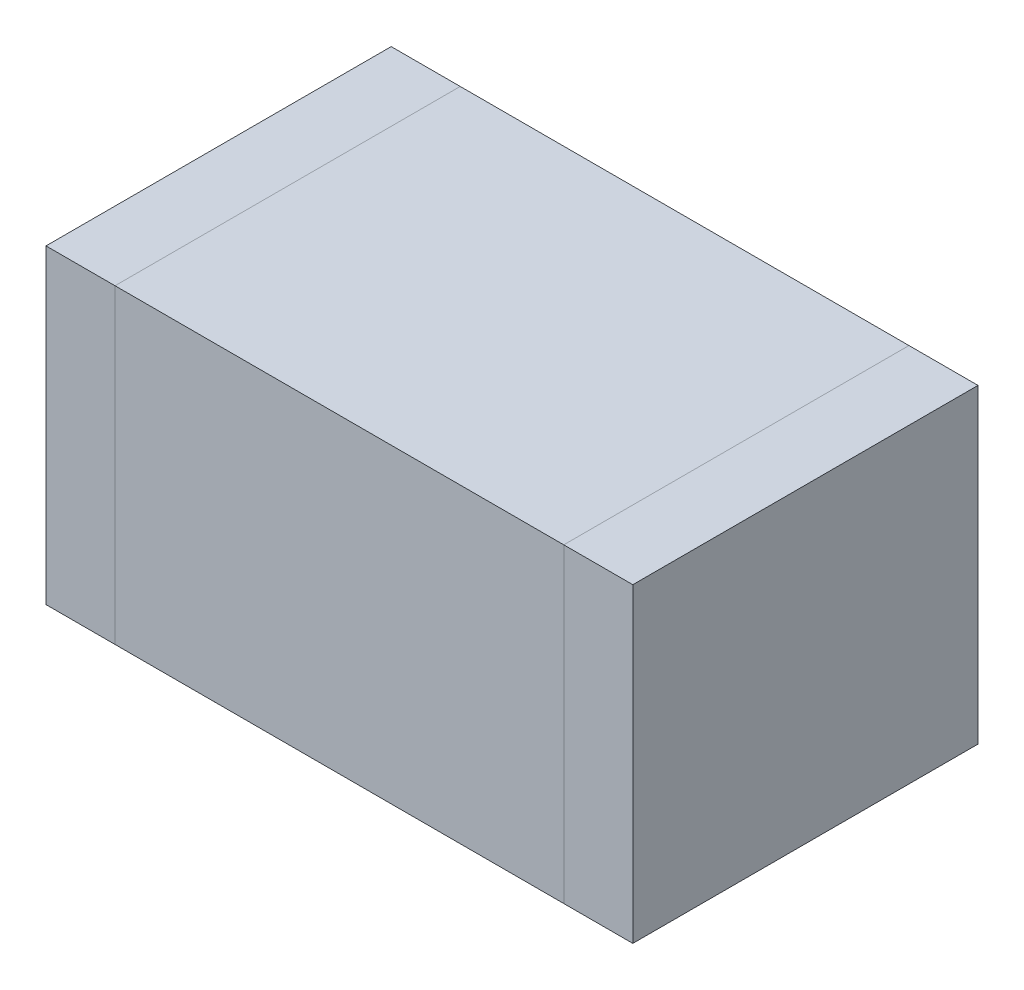
ISO-10303-21;
HEADER;
FILE_DESCRIPTION(('STEP AP214'),'2;1');
FILE_NAME('part.step','',(''),(''),'','','');
FILE_SCHEMA(('AUTOMOTIVE_DESIGN { 1 0 10303 214 1 1 1 1 }'));
ENDSEC;
DATA;
#1=APPLICATION_CONTEXT('core data for automotive mechanical design processes');
#2=APPLICATION_PROTOCOL_DEFINITION('international standard','automotive_design',2000,#1);
#3=PRODUCT_CONTEXT('',#1,'mechanical');
#4=PRODUCT('Part','Part','',(#3));
#5=PRODUCT_RELATED_PRODUCT_CATEGORY('part','',(#4));
#6=PRODUCT_DEFINITION_FORMATION('','',#4);
#7=PRODUCT_DEFINITION_CONTEXT('part definition',#1,'design');
#8=PRODUCT_DEFINITION('design','',#6,#7);
#9=PRODUCT_DEFINITION_SHAPE('','',#8);
#10=(LENGTH_UNIT() NAMED_UNIT(*) SI_UNIT(.MILLI.,.METRE.));
#11=(NAMED_UNIT(*) PLANE_ANGLE_UNIT() SI_UNIT($,.RADIAN.));
#12=(NAMED_UNIT(*) SI_UNIT($,.STERADIAN.) SOLID_ANGLE_UNIT());
#13=UNCERTAINTY_MEASURE_WITH_UNIT(LENGTH_MEASURE(1.E-05),#10,'distance_accuracy_value','');
#14=(GEOMETRIC_REPRESENTATION_CONTEXT(3) GLOBAL_UNCERTAINTY_ASSIGNED_CONTEXT((#13)) GLOBAL_UNIT_ASSIGNED_CONTEXT((#10,
#11,#12)) REPRESENTATION_CONTEXT('',''));
#15=CARTESIAN_POINT('',(0.,0.,0.));
#16=DIRECTION('',(0.,0.,1.));
#17=DIRECTION('',(1.,0.,0.));
#18=AXIS2_PLACEMENT_3D('',#15,#16,#17);
#19=CARTESIAN_POINT('',(0.8499983,0.4499991,0.));
#20=DIRECTION('',(1.,0.,0.));
#21=DIRECTION('',(0.,-1.,0.));
#22=AXIS2_PLACEMENT_3D('',#19,#20,#21);
#23=PLANE('',#22);
#24=DIRECTION('',(0.,0.,1.));
#25=VECTOR('',#24,1.);
#26=CARTESIAN_POINT('',(0.8499983,0.4499991,0.));
#27=LINE('',#26,#25);
#28=CARTESIAN_POINT('',(0.8499983,0.4499991,0.));
#29=VERTEX_POINT('',#28);
#30=CARTESIAN_POINT('',(0.8499983,0.4499991,1.00000054));
#31=VERTEX_POINT('',#30);
#32=EDGE_CURVE('P0_E11',#29,#31,#27,.T.);
#33=ORIENTED_EDGE('',*,*,#32,.T.);
#34=DIRECTION('',(0.,-1.,0.));
#35=VECTOR('',#34,1.);
#36=CARTESIAN_POINT('',(0.8499983,0.4499991,1.00000054));
#37=LINE('',#36,#35);
#38=CARTESIAN_POINT('',(0.8499983,-0.4499991,1.00000054));
#39=VERTEX_POINT('',#38);
#40=EDGE_CURVE('P0_E23',#31,#39,#37,.T.);
#41=ORIENTED_EDGE('',*,*,#40,.T.);
#42=DIRECTION('',(0.,0.,1.));
#43=VECTOR('',#42,1.);
#44=CARTESIAN_POINT('',(0.8499983,-0.4499991,0.));
#45=LINE('',#44,#43);
#46=CARTESIAN_POINT('',(0.8499983,-0.4499991,0.));
#47=VERTEX_POINT('',#46);
#48=EDGE_CURVE('P0_E83',#47,#39,#45,.T.);
#49=ORIENTED_EDGE('',*,*,#48,.F.);
#50=DIRECTION('',(0.,-1.,0.));
#51=VECTOR('',#50,1.);
#52=CARTESIAN_POINT('',(0.8499983,0.4499991,0.));
#53=LINE('',#52,#51);
#54=EDGE_CURVE('P0_E81',#29,#47,#53,.T.);
#55=ORIENTED_EDGE('',*,*,#54,.F.);
#56=EDGE_LOOP('',(#33,#41,#49,#55));
#57=FACE_BOUND('',#56,.T.);
#58=ADVANCED_FACE('P0_F16',(#57),#23,.T.);
#59=CARTESIAN_POINT('',(0.8499983,-0.4499991,0.));
#60=DIRECTION('',(0.,-1.,0.));
#61=DIRECTION('',(-1.,0.,0.));
#62=AXIS2_PLACEMENT_3D('',#59,#60,#61);
#63=PLANE('',#62);
#64=ORIENTED_EDGE('',*,*,#48,.T.);
#65=DIRECTION('',(-1.,0.,0.));
#66=VECTOR('',#65,1.);
#67=CARTESIAN_POINT('',(0.8499983,-0.4499991,1.00000054));
#68=LINE('',#67,#66);
#69=CARTESIAN_POINT('',(0.64999869999999,-0.4499991,1.00000054));
#70=VERTEX_POINT('',#69);
#71=EDGE_CURVE('P0_E78',#39,#70,#68,.T.);
#72=ORIENTED_EDGE('',*,*,#71,.T.);
#73=DIRECTION('',(0.,0.,1.));
#74=VECTOR('',#73,1.);
#75=CARTESIAN_POINT('',(0.64999869999999,-0.4499991,0.));
#76=LINE('',#75,#74);
#77=CARTESIAN_POINT('',(0.64999869999999,-0.4499991,0.));
#78=VERTEX_POINT('',#77);
#79=EDGE_CURVE('P0_E76',#78,#70,#76,.T.);
#80=ORIENTED_EDGE('',*,*,#79,.F.);
#81=DIRECTION('',(-1.,0.,0.));
#82=VECTOR('',#81,1.);
#83=CARTESIAN_POINT('',(0.8499983,-0.4499991,0.));
#84=LINE('',#83,#82);
#85=EDGE_CURVE('P0_E58',#47,#78,#84,.T.);
#86=ORIENTED_EDGE('',*,*,#85,.F.);
#87=EDGE_LOOP('',(#64,#72,#80,#86));
#88=FACE_BOUND('',#87,.T.);
#89=ADVANCED_FACE('P0_F89',(#88),#63,.T.);
#90=CARTESIAN_POINT('',(0.64999869999999,-0.4499991,0.));
#91=DIRECTION('',(-1.,0.,0.));
#92=DIRECTION('',(0.,1.,0.));
#93=AXIS2_PLACEMENT_3D('',#90,#91,#92);
#94=PLANE('',#93);
#95=ORIENTED_EDGE('',*,*,#79,.T.);
#96=DIRECTION('',(0.,1.,0.));
#97=VECTOR('',#96,1.);
#98=CARTESIAN_POINT('',(0.64999869999999,-0.4499991,1.00000054));
#99=LINE('',#98,#97);
#100=CARTESIAN_POINT('',(0.64999869999999,0.4499991,1.00000054));
#101=VERTEX_POINT('',#100);
#102=EDGE_CURVE('P0_E67',#70,#101,#99,.T.);
#103=ORIENTED_EDGE('',*,*,#102,.T.);
#104=DIRECTION('',(0.,0.,1.));
#105=VECTOR('',#104,1.);
#106=CARTESIAN_POINT('',(0.64999869999999,0.4499991,0.));
#107=LINE('',#106,#105);
#108=CARTESIAN_POINT('',(0.64999869999999,0.4499991,0.));
#109=VERTEX_POINT('',#108);
#110=EDGE_CURVE('P0_E62',#109,#101,#107,.T.);
#111=ORIENTED_EDGE('',*,*,#110,.F.);
#112=DIRECTION('',(0.,1.,0.));
#113=VECTOR('',#112,1.);
#114=CARTESIAN_POINT('',(0.64999869999999,-0.4499991,0.));
#115=LINE('',#114,#113);
#116=EDGE_CURVE('P0_E53',#78,#109,#115,.T.);
#117=ORIENTED_EDGE('',*,*,#116,.F.);
#118=EDGE_LOOP('',(#95,#103,#111,#117));
#119=FACE_BOUND('',#118,.T.);
#120=ADVANCED_FACE('P0_F66',(#119),#94,.T.);
#121=CARTESIAN_POINT('',(0.64999869999999,0.4499991,0.));
#122=DIRECTION('',(0.,1.,0.));
#123=DIRECTION('',(1.,0.,0.));
#124=AXIS2_PLACEMENT_3D('',#121,#122,#123);
#125=PLANE('',#124);
#126=ORIENTED_EDGE('',*,*,#110,.T.);
#127=DIRECTION('',(1.,0.,0.));
#128=VECTOR('',#127,1.);
#129=CARTESIAN_POINT('',(0.64999869999999,0.4499991,1.00000054));
#130=LINE('',#129,#128);
#131=EDGE_CURVE('P0_E63',#101,#31,#130,.T.);
#132=ORIENTED_EDGE('',*,*,#131,.T.);
#133=ORIENTED_EDGE('',*,*,#32,.F.);
#134=DIRECTION('',(1.,0.,0.));
#135=VECTOR('',#134,1.);
#136=CARTESIAN_POINT('',(0.64999869999999,0.4499991,0.));
#137=LINE('',#136,#135);
#138=EDGE_CURVE('P0_E57',#109,#29,#137,.T.);
#139=ORIENTED_EDGE('',*,*,#138,.F.);
#140=EDGE_LOOP('',(#126,#132,#133,#139));
#141=FACE_BOUND('',#140,.T.);
#142=ADVANCED_FACE('P0_F70',(#141),#125,.T.);
#143=CARTESIAN_POINT('',(0.749998499999997,0.,0.));
#144=DIRECTION('',(0.,0.,-1.));
#145=DIRECTION('',(1.,0.,0.));
#146=AXIS2_PLACEMENT_3D('',#143,#144,#145);
#147=PLANE('',#146);
#148=ORIENTED_EDGE('',*,*,#54,.T.);
#149=ORIENTED_EDGE('',*,*,#85,.T.);
#150=ORIENTED_EDGE('',*,*,#116,.T.);
#151=ORIENTED_EDGE('',*,*,#138,.T.);
#152=EDGE_LOOP('',(#148,#149,#150,#151));
#153=FACE_BOUND('',#152,.T.);
#154=ADVANCED_FACE('P0_F56',(#153),#147,.T.);
#155=CARTESIAN_POINT('',(0.749998499999997,0.,1.00000054));
#156=DIRECTION('',(0.,0.,-1.));
#157=DIRECTION('',(1.,0.,0.));
#158=AXIS2_PLACEMENT_3D('',#155,#156,#157);
#159=PLANE('',#158);
#160=ORIENTED_EDGE('',*,*,#131,.F.);
#161=ORIENTED_EDGE('',*,*,#102,.F.);
#162=ORIENTED_EDGE('',*,*,#71,.F.);
#163=ORIENTED_EDGE('',*,*,#40,.F.);
#164=EDGE_LOOP('',(#160,#161,#162,#163));
#165=FACE_BOUND('',#164,.T.);
#166=ADVANCED_FACE('P0_F90',(#165),#159,.F.);
#167=CLOSED_SHELL('',(#58,#89,#120,#142,#154,#166));
#168=MANIFOLD_SOLID_BREP('P0_B1',#167);
#169=CARTESIAN_POINT('',(-0.65000124,0.4499991,0.));
#170=DIRECTION('',(1.,0.,0.));
#171=DIRECTION('',(0.,-1.,0.));
#172=AXIS2_PLACEMENT_3D('',#169,#170,#171);
#173=PLANE('',#172);
#174=DIRECTION('',(0.,0.,1.));
#175=VECTOR('',#174,1.);
#176=CARTESIAN_POINT('',(-0.65000124,0.4499991,0.));
#177=LINE('',#176,#175);
#178=CARTESIAN_POINT('',(-0.65000124,0.4499991,0.));
#179=VERTEX_POINT('',#178);
#180=CARTESIAN_POINT('',(-0.65000124,0.4499991,1.00000054));
#181=VERTEX_POINT('',#180);
#182=EDGE_CURVE('P1_E11',#179,#181,#177,.T.);
#183=ORIENTED_EDGE('',*,*,#182,.T.);
#184=DIRECTION('',(0.,-1.,0.));
#185=VECTOR('',#184,1.);
#186=CARTESIAN_POINT('',(-0.65000124,0.4499991,1.00000054));
#187=LINE('',#186,#185);
#188=CARTESIAN_POINT('',(-0.65000124,-0.4499991,1.00000054));
#189=VERTEX_POINT('',#188);
#190=EDGE_CURVE('P1_E23',#181,#189,#187,.T.);
#191=ORIENTED_EDGE('',*,*,#190,.T.);
#192=DIRECTION('',(0.,0.,1.));
#193=VECTOR('',#192,1.);
#194=CARTESIAN_POINT('',(-0.65000124,-0.4499991,0.));
#195=LINE('',#194,#193);
#196=CARTESIAN_POINT('',(-0.65000124,-0.4499991,0.));
#197=VERTEX_POINT('',#196);
#198=EDGE_CURVE('P1_E83',#197,#189,#195,.T.);
#199=ORIENTED_EDGE('',*,*,#198,.F.);
#200=DIRECTION('',(0.,-1.,0.));
#201=VECTOR('',#200,1.);
#202=CARTESIAN_POINT('',(-0.65000124,0.4499991,0.));
#203=LINE('',#202,#201);
#204=EDGE_CURVE('P1_E81',#179,#197,#203,.T.);
#205=ORIENTED_EDGE('',*,*,#204,.F.);
#206=EDGE_LOOP('',(#183,#191,#199,#205));
#207=FACE_BOUND('',#206,.T.);
#208=ADVANCED_FACE('P1_F16',(#207),#173,.T.);
#209=CARTESIAN_POINT('',(-0.65000124,-0.4499991,0.));
#210=DIRECTION('',(0.,-1.,0.));
#211=DIRECTION('',(-1.,0.,0.));
#212=AXIS2_PLACEMENT_3D('',#209,#210,#211);
#213=PLANE('',#212);
#214=ORIENTED_EDGE('',*,*,#198,.T.);
#215=DIRECTION('',(-1.,0.,0.));
#216=VECTOR('',#215,1.);
#217=CARTESIAN_POINT('',(-0.65000124,-0.4499991,1.00000054));
#218=LINE('',#217,#216);
#219=CARTESIAN_POINT('',(-0.85000084000001,-0.4499991,1.00000054));
#220=VERTEX_POINT('',#219);
#221=EDGE_CURVE('P1_E78',#189,#220,#218,.T.);
#222=ORIENTED_EDGE('',*,*,#221,.T.);
#223=DIRECTION('',(0.,0.,1.));
#224=VECTOR('',#223,1.);
#225=CARTESIAN_POINT('',(-0.85000084000001,-0.4499991,0.));
#226=LINE('',#225,#224);
#227=CARTESIAN_POINT('',(-0.85000084000001,-0.4499991,0.));
#228=VERTEX_POINT('',#227);
#229=EDGE_CURVE('P1_E76',#228,#220,#226,.T.);
#230=ORIENTED_EDGE('',*,*,#229,.F.);
#231=DIRECTION('',(-1.,0.,0.));
#232=VECTOR('',#231,1.);
#233=CARTESIAN_POINT('',(-0.65000124,-0.4499991,0.));
#234=LINE('',#233,#232);
#235=EDGE_CURVE('P1_E57',#197,#228,#234,.T.);
#236=ORIENTED_EDGE('',*,*,#235,.F.);
#237=EDGE_LOOP('',(#214,#222,#230,#236));
#238=FACE_BOUND('',#237,.T.);
#239=ADVANCED_FACE('P1_F90',(#238),#213,.T.);
#240=CARTESIAN_POINT('',(-0.85000084000001,-0.4499991,0.));
#241=DIRECTION('',(-1.,0.,0.));
#242=DIRECTION('',(0.,1.,0.));
#243=AXIS2_PLACEMENT_3D('',#240,#241,#242);
#244=PLANE('',#243);
#245=ORIENTED_EDGE('',*,*,#229,.T.);
#246=DIRECTION('',(0.,1.,0.));
#247=VECTOR('',#246,1.);
#248=CARTESIAN_POINT('',(-0.85000084000001,-0.4499991,1.00000054));
#249=LINE('',#248,#247);
#250=CARTESIAN_POINT('',(-0.85000084000001,0.4499991,1.00000054));
#251=VERTEX_POINT('',#250);
#252=EDGE_CURVE('P1_E69',#220,#251,#249,.T.);
#253=ORIENTED_EDGE('',*,*,#252,.T.);
#254=DIRECTION('',(0.,0.,1.));
#255=VECTOR('',#254,1.);
#256=CARTESIAN_POINT('',(-0.85000084000001,0.4499991,0.));
#257=LINE('',#256,#255);
#258=CARTESIAN_POINT('',(-0.85000084000001,0.4499991,0.));
#259=VERTEX_POINT('',#258);
#260=EDGE_CURVE('P1_E62',#259,#251,#257,.T.);
#261=ORIENTED_EDGE('',*,*,#260,.F.);
#262=DIRECTION('',(0.,1.,0.));
#263=VECTOR('',#262,1.);
#264=CARTESIAN_POINT('',(-0.85000084000001,-0.4499991,0.));
#265=LINE('',#264,#263);
#266=EDGE_CURVE('P1_E53',#228,#259,#265,.T.);
#267=ORIENTED_EDGE('',*,*,#266,.F.);
#268=EDGE_LOOP('',(#245,#253,#261,#267));
#269=FACE_BOUND('',#268,.T.);
#270=ADVANCED_FACE('P1_F68',(#269),#244,.T.);
#271=CARTESIAN_POINT('',(-0.85000084000001,0.4499991,0.));
#272=DIRECTION('',(0.,1.,0.));
#273=DIRECTION('',(1.,0.,0.));
#274=AXIS2_PLACEMENT_3D('',#271,#272,#273);
#275=PLANE('',#274);
#276=ORIENTED_EDGE('',*,*,#260,.T.);
#277=DIRECTION('',(1.,0.,0.));
#278=VECTOR('',#277,1.);
#279=CARTESIAN_POINT('',(-0.85000084000001,0.4499991,1.00000054));
#280=LINE('',#279,#278);
#281=EDGE_CURVE('P1_E63',#251,#181,#280,.T.);
#282=ORIENTED_EDGE('',*,*,#281,.T.);
#283=ORIENTED_EDGE('',*,*,#182,.F.);
#284=DIRECTION('',(1.,0.,0.));
#285=VECTOR('',#284,1.);
#286=CARTESIAN_POINT('',(-0.85000084000001,0.4499991,0.));
#287=LINE('',#286,#285);
#288=EDGE_CURVE('P1_E56',#259,#179,#287,.T.);
#289=ORIENTED_EDGE('',*,*,#288,.F.);
#290=EDGE_LOOP('',(#276,#282,#283,#289));
#291=FACE_BOUND('',#290,.T.);
#292=ADVANCED_FACE('P1_F66',(#291),#275,.T.);
#293=CARTESIAN_POINT('',(-0.750001040000004,0.,0.));
#294=DIRECTION('',(0.,0.,-1.));
#295=DIRECTION('',(1.,0.,0.));
#296=AXIS2_PLACEMENT_3D('',#293,#294,#295);
#297=PLANE('',#296);
#298=ORIENTED_EDGE('',*,*,#204,.T.);
#299=ORIENTED_EDGE('',*,*,#235,.T.);
#300=ORIENTED_EDGE('',*,*,#266,.T.);
#301=ORIENTED_EDGE('',*,*,#288,.T.);
#302=EDGE_LOOP('',(#298,#299,#300,#301));
#303=FACE_BOUND('',#302,.T.);
#304=ADVANCED_FACE('P1_F55',(#303),#297,.T.);
#305=CARTESIAN_POINT('',(-0.750001040000004,0.,1.00000054));
#306=DIRECTION('',(0.,0.,-1.));
#307=DIRECTION('',(1.,0.,0.));
#308=AXIS2_PLACEMENT_3D('',#305,#306,#307);
#309=PLANE('',#308);
#310=ORIENTED_EDGE('',*,*,#281,.F.);
#311=ORIENTED_EDGE('',*,*,#252,.F.);
#312=ORIENTED_EDGE('',*,*,#221,.F.);
#313=ORIENTED_EDGE('',*,*,#190,.F.);
#314=EDGE_LOOP('',(#310,#311,#312,#313));
#315=FACE_BOUND('',#314,.T.);
#316=ADVANCED_FACE('P1_F88',(#315),#309,.F.);
#317=CLOSED_SHELL('',(#208,#239,#270,#292,#304,#316));
#318=MANIFOLD_SOLID_BREP('P1_B1',#317);
#319=CARTESIAN_POINT('',(0.6499987,0.4499991,0.));
#320=DIRECTION('',(1.,0.,0.));
#321=DIRECTION('',(0.,-1.,0.));
#322=AXIS2_PLACEMENT_3D('',#319,#320,#321);
#323=PLANE('',#322);
#324=DIRECTION('',(0.,0.,1.));
#325=VECTOR('',#324,1.);
#326=CARTESIAN_POINT('',(0.6499987,0.4499991,0.));
#327=LINE('',#326,#325);
#328=CARTESIAN_POINT('',(0.6499987,0.4499991,0.));
#329=VERTEX_POINT('',#328);
#330=CARTESIAN_POINT('',(0.6499987,0.4499991,1.00000054));
#331=VERTEX_POINT('',#330);
#332=EDGE_CURVE('P2_E11',#329,#331,#327,.T.);
#333=ORIENTED_EDGE('',*,*,#332,.T.);
#334=DIRECTION('',(0.,-1.,0.));
#335=VECTOR('',#334,1.);
#336=CARTESIAN_POINT('',(0.6499987,0.4499991,1.00000054));
#337=LINE('',#336,#335);
#338=CARTESIAN_POINT('',(0.6499987,-0.4499991,1.00000054));
#339=VERTEX_POINT('',#338);
#340=EDGE_CURVE('P2_E23',#331,#339,#337,.T.);
#341=ORIENTED_EDGE('',*,*,#340,.T.);
#342=DIRECTION('',(0.,0.,1.));
#343=VECTOR('',#342,1.);
#344=CARTESIAN_POINT('',(0.6499987,-0.4499991,0.));
#345=LINE('',#344,#343);
#346=CARTESIAN_POINT('',(0.6499987,-0.4499991,0.));
#347=VERTEX_POINT('',#346);
#348=EDGE_CURVE('P2_E83',#347,#339,#345,.T.);
#349=ORIENTED_EDGE('',*,*,#348,.F.);
#350=DIRECTION('',(0.,-1.,0.));
#351=VECTOR('',#350,1.);
#352=CARTESIAN_POINT('',(0.6499987,0.4499991,0.));
#353=LINE('',#352,#351);
#354=EDGE_CURVE('P2_E81',#329,#347,#353,.T.);
#355=ORIENTED_EDGE('',*,*,#354,.F.);
#356=EDGE_LOOP('',(#333,#341,#349,#355));
#357=FACE_BOUND('',#356,.T.);
#358=ADVANCED_FACE('P2_F16',(#357),#323,.T.);
#359=CARTESIAN_POINT('',(0.6499987,-0.4499991,0.));
#360=DIRECTION('',(0.,-1.,0.));
#361=DIRECTION('',(-1.,0.,0.));
#362=AXIS2_PLACEMENT_3D('',#359,#360,#361);
#363=PLANE('',#362);
#364=ORIENTED_EDGE('',*,*,#348,.T.);
#365=DIRECTION('',(-1.,0.,0.));
#366=VECTOR('',#365,1.);
#367=CARTESIAN_POINT('',(0.6499987,-0.4499991,1.00000054));
#368=LINE('',#367,#366);
#369=CARTESIAN_POINT('',(-0.65000124,-0.4499991,1.00000054));
#370=VERTEX_POINT('',#369);
#371=EDGE_CURVE('P2_E78',#339,#370,#368,.T.);
#372=ORIENTED_EDGE('',*,*,#371,.T.);
#373=DIRECTION('',(0.,0.,1.));
#374=VECTOR('',#373,1.);
#375=CARTESIAN_POINT('',(-0.65000124,-0.4499991,0.));
#376=LINE('',#375,#374);
#377=CARTESIAN_POINT('',(-0.65000124,-0.4499991,0.));
#378=VERTEX_POINT('',#377);
#379=EDGE_CURVE('P2_E76',#378,#370,#376,.T.);
#380=ORIENTED_EDGE('',*,*,#379,.F.);
#381=DIRECTION('',(-1.,0.,0.));
#382=VECTOR('',#381,1.);
#383=CARTESIAN_POINT('',(0.6499987,-0.4499991,0.));
#384=LINE('',#383,#382);
#385=EDGE_CURVE('P2_E67',#347,#378,#384,.T.);
#386=ORIENTED_EDGE('',*,*,#385,.F.);
#387=EDGE_LOOP('',(#364,#372,#380,#386));
#388=FACE_BOUND('',#387,.T.);
#389=ADVANCED_FACE('P2_F89',(#388),#363,.T.);
#390=CARTESIAN_POINT('',(-0.65000124,-0.4499991,0.));
#391=DIRECTION('',(-1.,0.,0.));
#392=DIRECTION('',(0.,1.,0.));
#393=AXIS2_PLACEMENT_3D('',#390,#391,#392);
#394=PLANE('',#393);
#395=ORIENTED_EDGE('',*,*,#379,.T.);
#396=DIRECTION('',(0.,1.,0.));
#397=VECTOR('',#396,1.);
#398=CARTESIAN_POINT('',(-0.65000124,-0.4499991,1.00000054));
#399=LINE('',#398,#397);
#400=CARTESIAN_POINT('',(-0.65000124,0.4499991,1.00000054));
#401=VERTEX_POINT('',#400);
#402=EDGE_CURVE('P2_E59',#370,#401,#399,.T.);
#403=ORIENTED_EDGE('',*,*,#402,.T.);
#404=DIRECTION('',(0.,0.,1.));
#405=VECTOR('',#404,1.);
#406=CARTESIAN_POINT('',(-0.65000124,0.4499991,0.));
#407=LINE('',#406,#405);
#408=CARTESIAN_POINT('',(-0.65000124,0.4499991,0.));
#409=VERTEX_POINT('',#408);
#410=EDGE_CURVE('P2_E53',#409,#401,#407,.T.);
#411=ORIENTED_EDGE('',*,*,#410,.F.);
#412=DIRECTION('',(0.,1.,0.));
#413=VECTOR('',#412,1.);
#414=CARTESIAN_POINT('',(-0.65000124,-0.4499991,0.));
#415=LINE('',#414,#413);
#416=EDGE_CURVE('P2_E57',#378,#409,#415,.T.);
#417=ORIENTED_EDGE('',*,*,#416,.F.);
#418=EDGE_LOOP('',(#395,#403,#411,#417));
#419=FACE_BOUND('',#418,.T.);
#420=ADVANCED_FACE('P2_F56',(#419),#394,.T.);
#421=CARTESIAN_POINT('',(-0.65000124,0.4499991,0.));
#422=DIRECTION('',(0.,1.,0.));
#423=DIRECTION('',(1.,0.,0.));
#424=AXIS2_PLACEMENT_3D('',#421,#422,#423);
#425=PLANE('',#424);
#426=ORIENTED_EDGE('',*,*,#410,.T.);
#427=DIRECTION('',(1.,0.,0.));
#428=VECTOR('',#427,1.);
#429=CARTESIAN_POINT('',(-0.65000124,0.4499991,1.00000054));
#430=LINE('',#429,#428);
#431=EDGE_CURVE('P2_E68',#401,#331,#430,.T.);
#432=ORIENTED_EDGE('',*,*,#431,.T.);
#433=ORIENTED_EDGE('',*,*,#332,.F.);
#434=DIRECTION('',(1.,0.,0.));
#435=VECTOR('',#434,1.);
#436=CARTESIAN_POINT('',(-0.65000124,0.4499991,0.));
#437=LINE('',#436,#435);
#438=EDGE_CURVE('P2_E66',#409,#329,#437,.T.);
#439=ORIENTED_EDGE('',*,*,#438,.F.);
#440=EDGE_LOOP('',(#426,#432,#433,#439));
#441=FACE_BOUND('',#440,.T.);
#442=ADVANCED_FACE('P2_F70',(#441),#425,.T.);
#443=CARTESIAN_POINT('',(-1.270000002059E-06,0.,0.));
#444=DIRECTION('',(0.,0.,-1.));
#445=DIRECTION('',(1.,0.,0.));
#446=AXIS2_PLACEMENT_3D('',#443,#444,#445);
#447=PLANE('',#446);
#448=ORIENTED_EDGE('',*,*,#354,.T.);
#449=ORIENTED_EDGE('',*,*,#385,.T.);
#450=ORIENTED_EDGE('',*,*,#416,.T.);
#451=ORIENTED_EDGE('',*,*,#438,.T.);
#452=EDGE_LOOP('',(#448,#449,#450,#451));
#453=FACE_BOUND('',#452,.T.);
#454=ADVANCED_FACE('P2_F65',(#453),#447,.T.);
#455=CARTESIAN_POINT('',(-1.270000002059E-06,0.,1.00000054));
#456=DIRECTION('',(0.,0.,-1.));
#457=DIRECTION('',(1.,0.,0.));
#458=AXIS2_PLACEMENT_3D('',#455,#456,#457);
#459=PLANE('',#458);
#460=ORIENTED_EDGE('',*,*,#431,.F.);
#461=ORIENTED_EDGE('',*,*,#402,.F.);
#462=ORIENTED_EDGE('',*,*,#371,.F.);
#463=ORIENTED_EDGE('',*,*,#340,.F.);
#464=EDGE_LOOP('',(#460,#461,#462,#463));
#465=FACE_BOUND('',#464,.T.);
#466=ADVANCED_FACE('P2_F90',(#465),#459,.F.);
#467=CLOSED_SHELL('',(#358,#389,#420,#442,#454,#466));
#468=MANIFOLD_SOLID_BREP('P2_B1',#467);
#469=ADVANCED_BREP_SHAPE_REPRESENTATION('',(#18,#168,#318,#468),#14);
#470=SHAPE_DEFINITION_REPRESENTATION(#9,#469);
ENDSEC;
END-ISO-10303-21;
